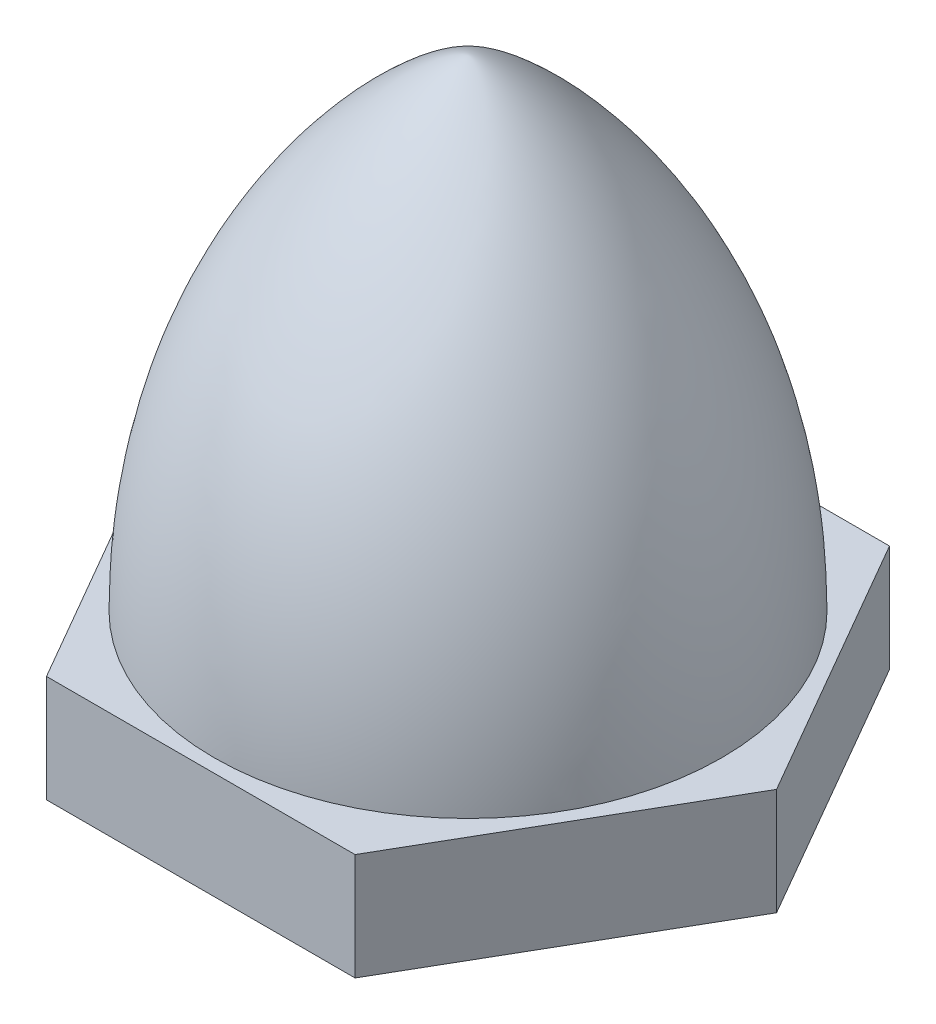
ISO-10303-21;
HEADER;
FILE_DESCRIPTION(('STEP AP214'),'2;1');
FILE_NAME('part.step','',(''),(''),'','','');
FILE_SCHEMA(('AUTOMOTIVE_DESIGN { 1 0 10303 214 1 1 1 1 }'));
ENDSEC;
DATA;
#1=APPLICATION_CONTEXT('core data for automotive mechanical design processes');
#2=APPLICATION_PROTOCOL_DEFINITION('international standard','automotive_design',2000,#1);
#3=PRODUCT_CONTEXT('',#1,'mechanical');
#4=PRODUCT('Part','Part','',(#3));
#5=PRODUCT_RELATED_PRODUCT_CATEGORY('part','',(#4));
#6=PRODUCT_DEFINITION_FORMATION('','',#4);
#7=PRODUCT_DEFINITION_CONTEXT('part definition',#1,'design');
#8=PRODUCT_DEFINITION('design','',#6,#7);
#9=PRODUCT_DEFINITION_SHAPE('','',#8);
#10=(LENGTH_UNIT() NAMED_UNIT(*) SI_UNIT(.MILLI.,.METRE.));
#11=(NAMED_UNIT(*) PLANE_ANGLE_UNIT() SI_UNIT($,.RADIAN.));
#12=(NAMED_UNIT(*) SI_UNIT($,.STERADIAN.) SOLID_ANGLE_UNIT());
#13=UNCERTAINTY_MEASURE_WITH_UNIT(LENGTH_MEASURE(1.E-05),#10,'distance_accuracy_value','');
#14=(GEOMETRIC_REPRESENTATION_CONTEXT(3) GLOBAL_UNCERTAINTY_ASSIGNED_CONTEXT((#13)) GLOBAL_UNIT_ASSIGNED_CONTEXT((#10,
#11,#12)) REPRESENTATION_CONTEXT('',''));
#15=CARTESIAN_POINT('',(0.,0.,0.));
#16=DIRECTION('',(0.,0.,1.));
#17=DIRECTION('',(1.,0.,0.));
#18=AXIS2_PLACEMENT_3D('',#15,#16,#17);
#19=CARTESIAN_POINT('',(0.,2.,0.));
#20=DIRECTION('',(0.,1.,0.));
#21=DIRECTION('',(0.,0.,1.));
#22=AXIS2_PLACEMENT_3D('',#19,#20,#21);
#23=PLANE('',#22);
#24=DIRECTION('',(-0.5,0.,-0.866025403784438));
#25=VECTOR('',#24,1.);
#26=CARTESIAN_POINT('',(5.77350269189626,2.,0.));
#27=LINE('',#26,#25);
#28=CARTESIAN_POINT('',(5.77350269189626,2.,0.));
#29=VERTEX_POINT('',#28);
#30=CARTESIAN_POINT('',(2.88675134594813,2.,-5.));
#31=VERTEX_POINT('',#30);
#32=EDGE_CURVE('E134',#29,#31,#27,.T.);
#33=ORIENTED_EDGE('',*,*,#32,.T.);
#34=DIRECTION('',(-1.,0.,0.));
#35=VECTOR('',#34,1.);
#36=CARTESIAN_POINT('',(2.88675134594813,2.,-5.));
#37=LINE('',#36,#35);
#38=CARTESIAN_POINT('',(-2.88675134594813,2.,-5.));
#39=VERTEX_POINT('',#38);
#40=EDGE_CURVE('E90',#31,#39,#37,.T.);
#41=ORIENTED_EDGE('',*,*,#40,.T.);
#42=DIRECTION('',(-0.5,0.,0.866025403784438));
#43=VECTOR('',#42,1.);
#44=CARTESIAN_POINT('',(-2.88675134594813,2.,-5.));
#45=LINE('',#44,#43);
#46=CARTESIAN_POINT('',(-5.77350269189626,2.,0.));
#47=VERTEX_POINT('',#46);
#48=EDGE_CURVE('E105',#39,#47,#45,.T.);
#49=ORIENTED_EDGE('',*,*,#48,.T.);
#50=DIRECTION('',(0.5,0.,0.866025403784439));
#51=VECTOR('',#50,1.);
#52=CARTESIAN_POINT('',(-5.77350269189626,2.,0.));
#53=LINE('',#52,#51);
#54=CARTESIAN_POINT('',(-2.88675134594813,2.,5.));
#55=VERTEX_POINT('',#54);
#56=EDGE_CURVE('E99',#47,#55,#53,.T.);
#57=ORIENTED_EDGE('',*,*,#56,.T.);
#58=DIRECTION('',(1.,0.,0.));
#59=VECTOR('',#58,1.);
#60=CARTESIAN_POINT('',(-2.88675134594813,2.,5.));
#61=LINE('',#60,#59);
#62=CARTESIAN_POINT('',(2.88675134594813,2.,5.));
#63=VERTEX_POINT('',#62);
#64=EDGE_CURVE('E103',#55,#63,#61,.T.);
#65=ORIENTED_EDGE('',*,*,#64,.T.);
#66=DIRECTION('',(0.5,0.,-0.866025403784438));
#67=VECTOR('',#66,1.);
#68=CARTESIAN_POINT('',(2.88675134594813,2.,5.));
#69=LINE('',#68,#67);
#70=EDGE_CURVE('E52',#63,#29,#69,.T.);
#71=ORIENTED_EDGE('',*,*,#70,.T.);
#72=EDGE_LOOP('',(#33,#41,#49,#57,#65,#71));
#73=FACE_BOUND('',#72,.T.);
#74=CARTESIAN_POINT('',(0.,2.,0.));
#75=DIRECTION('',(0.,1.,0.));
#76=DIRECTION('',(0.,0.,1.));
#77=AXIS2_PLACEMENT_3D('',#74,#75,#76);
#78=CIRCLE('',#77,4.75);
#79=CARTESIAN_POINT('',(0.,2.,4.75));
#80=VERTEX_POINT('',#79);
#81=EDGE_CURVE('E127',#80,#80,#78,.T.);
#82=ORIENTED_EDGE('',*,*,#81,.F.);
#83=EDGE_LOOP('',(#82));
#84=FACE_BOUND('',#83,.T.);
#85=ADVANCED_FACE('F35',(#73,#84),#23,.T.);
#86=CARTESIAN_POINT('',(5.77350269189626,2.,0.));
#87=DIRECTION('',(-0.866025403784438,0.,0.5));
#88=DIRECTION('',(0.5,0.,0.866025403784439));
#89=AXIS2_PLACEMENT_3D('',#86,#87,#88);
#90=PLANE('',#89);
#91=DIRECTION('',(-0.5,0.,-0.866025403784438));
#92=VECTOR('',#91,1.);
#93=CARTESIAN_POINT('',(5.77350269189626,0.,0.));
#94=LINE('',#93,#92);
#95=CARTESIAN_POINT('',(5.77350269189626,0.,0.));
#96=VERTEX_POINT('',#95);
#97=CARTESIAN_POINT('',(2.88675134594813,0.,-5.));
#98=VERTEX_POINT('',#97);
#99=EDGE_CURVE('E123',#96,#98,#94,.T.);
#100=ORIENTED_EDGE('',*,*,#99,.T.);
#101=DIRECTION('',(0.,-1.,0.));
#102=VECTOR('',#101,1.);
#103=CARTESIAN_POINT('',(2.88675134594813,2.,-5.));
#104=LINE('',#103,#102);
#105=EDGE_CURVE('E11',#31,#98,#104,.T.);
#106=ORIENTED_EDGE('',*,*,#105,.F.);
#107=ORIENTED_EDGE('',*,*,#32,.F.);
#108=DIRECTION('',(0.,-1.,0.));
#109=VECTOR('',#108,1.);
#110=CARTESIAN_POINT('',(5.77350269189626,2.,0.));
#111=LINE('',#110,#109);
#112=EDGE_CURVE('E119',#29,#96,#111,.T.);
#113=ORIENTED_EDGE('',*,*,#112,.T.);
#114=EDGE_LOOP('',(#100,#106,#107,#113));
#115=FACE_BOUND('',#114,.T.);
#116=ADVANCED_FACE('F37',(#115),#90,.F.);
#117=CARTESIAN_POINT('',(2.88675134594813,2.,-5.));
#118=DIRECTION('',(0.,0.,1.));
#119=DIRECTION('',(1.,0.,0.));
#120=AXIS2_PLACEMENT_3D('',#117,#118,#119);
#121=PLANE('',#120);
#122=DIRECTION('',(-1.,0.,0.));
#123=VECTOR('',#122,1.);
#124=CARTESIAN_POINT('',(2.88675134594813,0.,-5.));
#125=LINE('',#124,#123);
#126=CARTESIAN_POINT('',(-2.88675134594813,0.,-5.));
#127=VERTEX_POINT('',#126);
#128=EDGE_CURVE('E126',#98,#127,#125,.T.);
#129=ORIENTED_EDGE('',*,*,#128,.T.);
#130=DIRECTION('',(0.,-1.,0.));
#131=VECTOR('',#130,1.);
#132=CARTESIAN_POINT('',(-2.88675134594813,2.,-5.));
#133=LINE('',#132,#131);
#134=EDGE_CURVE('E44',#39,#127,#133,.T.);
#135=ORIENTED_EDGE('',*,*,#134,.F.);
#136=ORIENTED_EDGE('',*,*,#40,.F.);
#137=ORIENTED_EDGE('',*,*,#105,.T.);
#138=EDGE_LOOP('',(#129,#135,#136,#137));
#139=FACE_BOUND('',#138,.T.);
#140=ADVANCED_FACE('F163',(#139),#121,.F.);
#141=CARTESIAN_POINT('',(-2.88675134594813,2.,-5.));
#142=DIRECTION('',(0.866025403784438,0.,0.5));
#143=DIRECTION('',(0.5,0.,-0.866025403784439));
#144=AXIS2_PLACEMENT_3D('',#141,#142,#143);
#145=PLANE('',#144);
#146=DIRECTION('',(-0.5,0.,0.866025403784438));
#147=VECTOR('',#146,1.);
#148=CARTESIAN_POINT('',(-2.88675134594813,0.,-5.));
#149=LINE('',#148,#147);
#150=CARTESIAN_POINT('',(-5.77350269189626,0.,0.));
#151=VERTEX_POINT('',#150);
#152=EDGE_CURVE('E129',#127,#151,#149,.T.);
#153=ORIENTED_EDGE('',*,*,#152,.T.);
#154=DIRECTION('',(0.,-1.,0.));
#155=VECTOR('',#154,1.);
#156=CARTESIAN_POINT('',(-5.77350269189626,2.,0.));
#157=LINE('',#156,#155);
#158=EDGE_CURVE('E114',#47,#151,#157,.T.);
#159=ORIENTED_EDGE('',*,*,#158,.F.);
#160=ORIENTED_EDGE('',*,*,#48,.F.);
#161=ORIENTED_EDGE('',*,*,#134,.T.);
#162=EDGE_LOOP('',(#153,#159,#160,#161));
#163=FACE_BOUND('',#162,.T.);
#164=ADVANCED_FACE('F140',(#163),#145,.F.);
#165=CARTESIAN_POINT('',(-5.77350269189626,2.,0.));
#166=DIRECTION('',(0.866025403784439,0.,-0.5));
#167=DIRECTION('',(-0.5,0.,-0.866025403784439));
#168=AXIS2_PLACEMENT_3D('',#165,#166,#167);
#169=PLANE('',#168);
#170=DIRECTION('',(0.5,0.,0.866025403784439));
#171=VECTOR('',#170,1.);
#172=CARTESIAN_POINT('',(-5.77350269189626,0.,0.));
#173=LINE('',#172,#171);
#174=CARTESIAN_POINT('',(-2.88675134594813,0.,5.));
#175=VERTEX_POINT('',#174);
#176=EDGE_CURVE('E113',#151,#175,#173,.T.);
#177=ORIENTED_EDGE('',*,*,#176,.T.);
#178=DIRECTION('',(0.,-1.,0.));
#179=VECTOR('',#178,1.);
#180=CARTESIAN_POINT('',(-2.88675134594813,2.,5.));
#181=LINE('',#180,#179);
#182=EDGE_CURVE('E110',#55,#175,#181,.T.);
#183=ORIENTED_EDGE('',*,*,#182,.F.);
#184=ORIENTED_EDGE('',*,*,#56,.F.);
#185=ORIENTED_EDGE('',*,*,#158,.T.);
#186=EDGE_LOOP('',(#177,#183,#184,#185));
#187=FACE_BOUND('',#186,.T.);
#188=ADVANCED_FACE('F111',(#187),#169,.F.);
#189=CARTESIAN_POINT('',(-2.88675134594813,2.,5.));
#190=DIRECTION('',(0.,0.,-1.));
#191=DIRECTION('',(-1.,0.,0.));
#192=AXIS2_PLACEMENT_3D('',#189,#190,#191);
#193=PLANE('',#192);
#194=DIRECTION('',(1.,0.,0.));
#195=VECTOR('',#194,1.);
#196=CARTESIAN_POINT('',(-2.88675134594813,0.,5.));
#197=LINE('',#196,#195);
#198=CARTESIAN_POINT('',(2.88675134594813,0.,5.));
#199=VERTEX_POINT('',#198);
#200=EDGE_CURVE('E76',#175,#199,#197,.T.);
#201=ORIENTED_EDGE('',*,*,#200,.T.);
#202=DIRECTION('',(0.,-1.,0.));
#203=VECTOR('',#202,1.);
#204=CARTESIAN_POINT('',(2.88675134594813,2.,5.));
#205=LINE('',#204,#203);
#206=EDGE_CURVE('E115',#63,#199,#205,.T.);
#207=ORIENTED_EDGE('',*,*,#206,.F.);
#208=ORIENTED_EDGE('',*,*,#64,.F.);
#209=ORIENTED_EDGE('',*,*,#182,.T.);
#210=EDGE_LOOP('',(#201,#207,#208,#209));
#211=FACE_BOUND('',#210,.T.);
#212=ADVANCED_FACE('F117',(#211),#193,.F.);
#213=CARTESIAN_POINT('',(2.88675134594813,2.,5.));
#214=DIRECTION('',(-0.866025403784438,0.,-0.5));
#215=DIRECTION('',(-0.5,0.,0.866025403784439));
#216=AXIS2_PLACEMENT_3D('',#213,#214,#215);
#217=PLANE('',#216);
#218=DIRECTION('',(0.5,0.,-0.866025403784438));
#219=VECTOR('',#218,1.);
#220=CARTESIAN_POINT('',(2.88675134594813,0.,5.));
#221=LINE('',#220,#219);
#222=EDGE_CURVE('E82',#199,#96,#221,.T.);
#223=ORIENTED_EDGE('',*,*,#222,.T.);
#224=ORIENTED_EDGE('',*,*,#112,.F.);
#225=ORIENTED_EDGE('',*,*,#70,.F.);
#226=ORIENTED_EDGE('',*,*,#206,.T.);
#227=EDGE_LOOP('',(#223,#224,#225,#226));
#228=FACE_BOUND('',#227,.T.);
#229=ADVANCED_FACE('F147',(#228),#217,.F.);
#230=CARTESIAN_POINT('',(0.,0.,0.));
#231=DIRECTION('',(0.,1.,0.));
#232=DIRECTION('',(0.,0.,1.));
#233=AXIS2_PLACEMENT_3D('',#230,#231,#232);
#234=PLANE('',#233);
#235=CARTESIAN_POINT('',(0.,0.,0.));
#236=DIRECTION('',(0.,-1.,0.));
#237=DIRECTION('',(0.,0.,-1.));
#238=AXIS2_PLACEMENT_3D('',#235,#236,#237);
#239=CIRCLE('',#238,2.1);
#240=CARTESIAN_POINT('',(0.,0.,-2.1));
#241=VERTEX_POINT('',#240);
#242=EDGE_CURVE('E187',#241,#241,#239,.T.);
#243=ORIENTED_EDGE('',*,*,#242,.F.);
#244=EDGE_LOOP('',(#243));
#245=FACE_BOUND('',#244,.T.);
#246=ORIENTED_EDGE('',*,*,#99,.F.);
#247=ORIENTED_EDGE('',*,*,#222,.F.);
#248=ORIENTED_EDGE('',*,*,#200,.F.);
#249=ORIENTED_EDGE('',*,*,#176,.F.);
#250=ORIENTED_EDGE('',*,*,#152,.F.);
#251=ORIENTED_EDGE('',*,*,#128,.F.);
#252=EDGE_LOOP('',(#246,#247,#248,#249,#250,#251));
#253=FACE_BOUND('',#252,.T.);
#254=ADVANCED_FACE('F143',(#245,#253),#234,.F.);
#255=CARTESIAN_POINT('',(4.75,1.99999999999999,0.));
#256=CARTESIAN_POINT('',(4.75,8.00423685453355,0.));
#257=CARTESIAN_POINT('',(0.622499021746548,11.,0.));
#258=CARTESIAN_POINT('',(0.,11.,0.));
#259=B_SPLINE_CURVE_WITH_KNOTS('',3,(#255,#256,#257,#258),.UNSPECIFIED.,.F.,.F.,(4,4),(0.,1.),.UNSPECIFIED.);
#260=CARTESIAN_POINT('',(0.,11.,0.));
#261=DIRECTION('',(0.,1.,0.));
#262=AXIS1_PLACEMENT('',#260,#261);
#263=SURFACE_OF_REVOLUTION('',#259,#262);
#264=CARTESIAN_POINT('',(0.,11.,0.));
#265=VERTEX_POINT('',#264);
#266=VERTEX_LOOP('',#265);
#267=FACE_BOUND('',#266,.T.);
#268=ORIENTED_EDGE('',*,*,#81,.T.);
#269=EDGE_LOOP('',(#268));
#270=FACE_BOUND('',#269,.T.);
#271=ADVANCED_FACE('F154',(#267,#270),#263,.T.);
#272=CARTESIAN_POINT('',(0.,5.,0.));
#273=DIRECTION('',(0.,-1.,0.));
#274=DIRECTION('',(0.,0.,-1.));
#275=AXIS2_PLACEMENT_3D('',#272,#273,#274);
#276=CONICAL_SURFACE('',#275,2.1,1.02974425867665);
#277=CARTESIAN_POINT('',(0.,6.26180729995788,0.));
#278=VERTEX_POINT('',#277);
#279=VERTEX_LOOP('',#278);
#280=FACE_BOUND('',#279,.T.);
#281=CARTESIAN_POINT('',(0.,5.,0.));
#282=DIRECTION('',(0.,-1.,0.));
#283=DIRECTION('',(0.,0.,-1.));
#284=AXIS2_PLACEMENT_3D('',#281,#282,#283);
#285=CIRCLE('',#284,2.1);
#286=CARTESIAN_POINT('',(0.,5.,-2.1));
#287=VERTEX_POINT('',#286);
#288=EDGE_CURVE('E176',#287,#287,#285,.T.);
#289=ORIENTED_EDGE('',*,*,#288,.T.);
#290=EDGE_LOOP('',(#289));
#291=FACE_BOUND('',#290,.T.);
#292=ADVANCED_FACE('F168',(#280,#291),#276,.F.);
#293=CARTESIAN_POINT('',(0.,0.,0.));
#294=DIRECTION('',(0.,-1.,0.));
#295=DIRECTION('',(0.,0.,-1.));
#296=AXIS2_PLACEMENT_3D('',#293,#294,#295);
#297=CYLINDRICAL_SURFACE('',#296,2.1);
#298=ORIENTED_EDGE('',*,*,#288,.F.);
#299=EDGE_LOOP('',(#298));
#300=FACE_BOUND('',#299,.T.);
#301=ORIENTED_EDGE('',*,*,#242,.T.);
#302=EDGE_LOOP('',(#301));
#303=FACE_BOUND('',#302,.T.);
#304=ADVANCED_FACE('F193',(#300,#303),#297,.F.);
#305=CLOSED_SHELL('',(#85,#116,#140,#164,#188,#212,#229,#254,#271,#292,#304));
#306=MANIFOLD_SOLID_BREP('B2',#305);
#307=ADVANCED_BREP_SHAPE_REPRESENTATION('',(#18,#306),#14);
#308=SHAPE_DEFINITION_REPRESENTATION(#9,#307);
ENDSEC;
END-ISO-10303-21;
